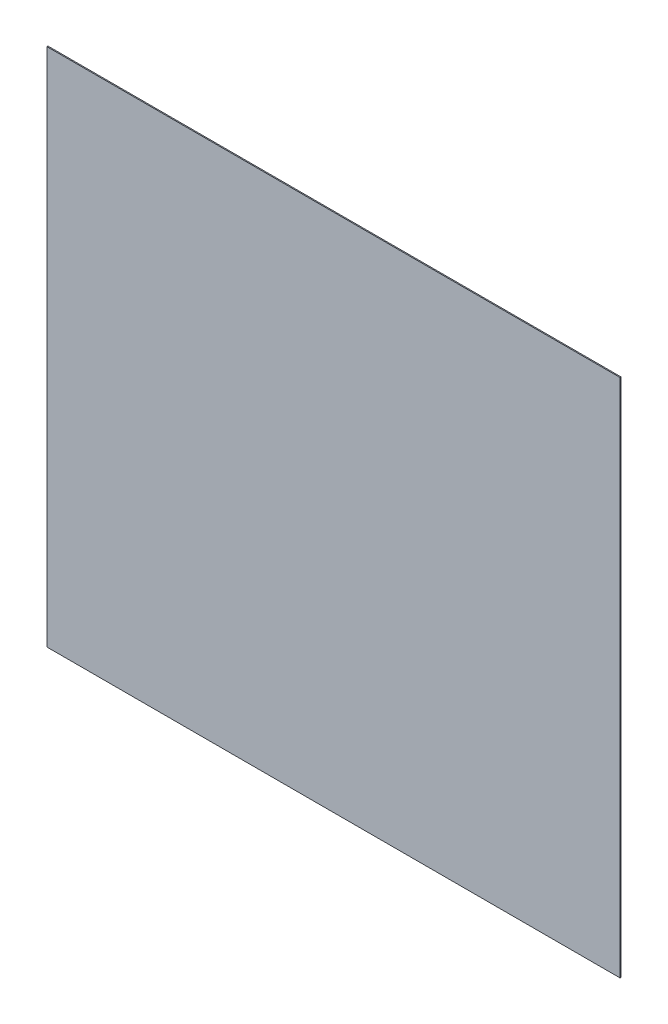
ISO-10303-21;
HEADER;
FILE_DESCRIPTION(('STEP AP214'),'2;1');
FILE_NAME('part.step','',(''),(''),'','','');
FILE_SCHEMA(('AUTOMOTIVE_DESIGN { 1 0 10303 214 1 1 1 1 }'));
ENDSEC;
DATA;
#1=APPLICATION_CONTEXT('core data for automotive mechanical design processes');
#2=APPLICATION_PROTOCOL_DEFINITION('international standard','automotive_design',2000,#1);
#3=PRODUCT_CONTEXT('',#1,'mechanical');
#4=PRODUCT('Part','Part','',(#3));
#5=PRODUCT_RELATED_PRODUCT_CATEGORY('part','',(#4));
#6=PRODUCT_DEFINITION_FORMATION('','',#4);
#7=PRODUCT_DEFINITION_CONTEXT('part definition',#1,'design');
#8=PRODUCT_DEFINITION('design','',#6,#7);
#9=PRODUCT_DEFINITION_SHAPE('','',#8);
#10=(LENGTH_UNIT() NAMED_UNIT(*) SI_UNIT(.MILLI.,.METRE.));
#11=(NAMED_UNIT(*) PLANE_ANGLE_UNIT() SI_UNIT($,.RADIAN.));
#12=(NAMED_UNIT(*) SI_UNIT($,.STERADIAN.) SOLID_ANGLE_UNIT());
#13=UNCERTAINTY_MEASURE_WITH_UNIT(LENGTH_MEASURE(1.E-05),#10,'distance_accuracy_value','');
#14=(GEOMETRIC_REPRESENTATION_CONTEXT(3) GLOBAL_UNCERTAINTY_ASSIGNED_CONTEXT((#13)) GLOBAL_UNIT_ASSIGNED_CONTEXT((#10,
#11,#12)) REPRESENTATION_CONTEXT('',''));
#15=CARTESIAN_POINT('',(0.,0.,0.));
#16=DIRECTION('',(0.,0.,1.));
#17=DIRECTION('',(1.,0.,0.));
#18=AXIS2_PLACEMENT_3D('',#15,#16,#17);
#19=CARTESIAN_POINT('',(2.158834554924E-05,-9.664392011418E-06,0.00100076));
#20=DIRECTION('',(0.,0.,1.));
#21=DIRECTION('',(1.,0.,0.));
#22=AXIS2_PLACEMENT_3D('',#19,#20,#21);
#23=PLANE('',#22);
#24=DIRECTION('',(-1.,0.,0.));
#25=VECTOR('',#24,1.);
#26=CARTESIAN_POINT('',(0.27518868,0.24957024,0.00100076));
#27=LINE('',#26,#25);
#28=CARTESIAN_POINT('',(0.27518868,0.24957024,0.00100076));
#29=VERTEX_POINT('',#28);
#30=CARTESIAN_POINT('',(-0.27510486,0.24957024,0.00100076));
#31=VERTEX_POINT('',#30);
#32=EDGE_CURVE('E84',#29,#31,#27,.T.);
#33=ORIENTED_EDGE('',*,*,#32,.T.);
#34=DIRECTION('',(-0.000162839926169632,-0.999999986741579,0.));
#35=VECTOR('',#34,1.);
#36=CARTESIAN_POINT('',(-0.27510486,0.24957024,0.00100076));
#37=LINE('',#36,#35);
#38=CARTESIAN_POINT('',(-0.27518614,-0.24957024,0.00100076));
#39=VERTEX_POINT('',#38);
#40=EDGE_CURVE('E99',#31,#39,#37,.T.);
#41=ORIENTED_EDGE('',*,*,#40,.T.);
#42=DIRECTION('',(1.,0.,0.));
#43=VECTOR('',#42,1.);
#44=CARTESIAN_POINT('',(-0.27518614,-0.24957024,0.00100076));
#45=LINE('',#44,#43);
#46=CARTESIAN_POINT('',(0.27518868,-0.24957024,0.00100076));
#47=VERTEX_POINT('',#46);
#48=EDGE_CURVE('E21',#39,#47,#45,.T.);
#49=ORIENTED_EDGE('',*,*,#48,.T.);
#50=DIRECTION('',(0.,1.,0.));
#51=VECTOR('',#50,1.);
#52=CARTESIAN_POINT('',(0.27518868,-0.24957024,0.00100076));
#53=LINE('',#52,#51);
#54=EDGE_CURVE('E11',#47,#29,#53,.T.);
#55=ORIENTED_EDGE('',*,*,#54,.T.);
#56=EDGE_LOOP('',(#33,#41,#49,#55));
#57=FACE_BOUND('',#56,.T.);
#58=ADVANCED_FACE('F17',(#57),#23,.T.);
#59=CARTESIAN_POINT('',(2.158834554924E-05,-9.664392011418E-06,0.));
#60=DIRECTION('',(0.,0.,1.));
#61=DIRECTION('',(1.,0.,0.));
#62=AXIS2_PLACEMENT_3D('',#59,#60,#61);
#63=PLANE('',#62);
#64=DIRECTION('',(0.,1.,0.));
#65=VECTOR('',#64,1.);
#66=CARTESIAN_POINT('',(0.27518868,-0.24957024,0.));
#67=LINE('',#66,#65);
#68=CARTESIAN_POINT('',(0.27518868,-0.24957024,0.));
#69=VERTEX_POINT('',#68);
#70=CARTESIAN_POINT('',(0.27518868,0.24957024,0.));
#71=VERTEX_POINT('',#70);
#72=EDGE_CURVE('E27',#69,#71,#67,.T.);
#73=ORIENTED_EDGE('',*,*,#72,.F.);
#74=DIRECTION('',(1.,0.,0.));
#75=VECTOR('',#74,1.);
#76=CARTESIAN_POINT('',(-0.27518614,-0.24957024,0.));
#77=LINE('',#76,#75);
#78=CARTESIAN_POINT('',(-0.27518614,-0.24957024,0.));
#79=VERTEX_POINT('',#78);
#80=EDGE_CURVE('E103',#79,#69,#77,.T.);
#81=ORIENTED_EDGE('',*,*,#80,.F.);
#82=DIRECTION('',(-0.000162839926169632,-0.999999986741579,0.));
#83=VECTOR('',#82,1.);
#84=CARTESIAN_POINT('',(-0.27510486,0.24957024,0.));
#85=LINE('',#84,#83);
#86=CARTESIAN_POINT('',(-0.27510486,0.24957024,0.));
#87=VERTEX_POINT('',#86);
#88=EDGE_CURVE('E86',#87,#79,#85,.T.);
#89=ORIENTED_EDGE('',*,*,#88,.F.);
#90=DIRECTION('',(-1.,0.,0.));
#91=VECTOR('',#90,1.);
#92=CARTESIAN_POINT('',(0.27518868,0.24957024,0.));
#93=LINE('',#92,#91);
#94=EDGE_CURVE('E82',#71,#87,#93,.T.);
#95=ORIENTED_EDGE('',*,*,#94,.F.);
#96=EDGE_LOOP('',(#73,#81,#89,#95));
#97=FACE_BOUND('',#96,.T.);
#98=ADVANCED_FACE('F19',(#97),#63,.F.);
#99=CARTESIAN_POINT('',(0.27518868,-0.24957024,0.));
#100=DIRECTION('',(-1.,0.,0.));
#101=DIRECTION('',(0.,0.,1.));
#102=AXIS2_PLACEMENT_3D('',#99,#100,#101);
#103=PLANE('',#102);
#104=ORIENTED_EDGE('',*,*,#72,.T.);
#105=DIRECTION('',(0.,0.,1.));
#106=VECTOR('',#105,1.);
#107=CARTESIAN_POINT('',(0.27518868,0.24957024,0.));
#108=LINE('',#107,#106);
#109=EDGE_CURVE('E71',#71,#29,#108,.T.);
#110=ORIENTED_EDGE('',*,*,#109,.T.);
#111=ORIENTED_EDGE('',*,*,#54,.F.);
#112=DIRECTION('',(0.,0.,1.));
#113=VECTOR('',#112,1.);
#114=CARTESIAN_POINT('',(0.27518868,-0.24957024,0.));
#115=LINE('',#114,#113);
#116=EDGE_CURVE('E74',#69,#47,#115,.T.);
#117=ORIENTED_EDGE('',*,*,#116,.F.);
#118=EDGE_LOOP('',(#104,#110,#111,#117));
#119=FACE_BOUND('',#118,.T.);
#120=ADVANCED_FACE('F70',(#119),#103,.F.);
#121=CARTESIAN_POINT('',(-0.27518614,-0.24957024,0.));
#122=DIRECTION('',(0.,1.,0.));
#123=DIRECTION('',(1.,0.,0.));
#124=AXIS2_PLACEMENT_3D('',#121,#122,#123);
#125=PLANE('',#124);
#126=ORIENTED_EDGE('',*,*,#80,.T.);
#127=ORIENTED_EDGE('',*,*,#116,.T.);
#128=ORIENTED_EDGE('',*,*,#48,.F.);
#129=DIRECTION('',(0.,0.,1.));
#130=VECTOR('',#129,1.);
#131=CARTESIAN_POINT('',(-0.27518614,-0.24957024,0.));
#132=LINE('',#131,#130);
#133=EDGE_CURVE('E104',#79,#39,#132,.T.);
#134=ORIENTED_EDGE('',*,*,#133,.F.);
#135=EDGE_LOOP('',(#126,#127,#128,#134));
#136=FACE_BOUND('',#135,.T.);
#137=ADVANCED_FACE('F119',(#136),#125,.F.);
#138=CARTESIAN_POINT('',(-0.27510486,0.24957024,0.));
#139=DIRECTION('',(0.999999986741579,-0.000162839926169632,0.));
#140=DIRECTION('',(0.,0.,-1.));
#141=AXIS2_PLACEMENT_3D('',#138,#139,#140);
#142=PLANE('',#141);
#143=ORIENTED_EDGE('',*,*,#88,.T.);
#144=ORIENTED_EDGE('',*,*,#133,.T.);
#145=ORIENTED_EDGE('',*,*,#40,.F.);
#146=DIRECTION('',(0.,0.,1.));
#147=VECTOR('',#146,1.);
#148=CARTESIAN_POINT('',(-0.27510486,0.24957024,0.));
#149=LINE('',#148,#147);
#150=EDGE_CURVE('E91',#87,#31,#149,.T.);
#151=ORIENTED_EDGE('',*,*,#150,.F.);
#152=EDGE_LOOP('',(#143,#144,#145,#151));
#153=FACE_BOUND('',#152,.T.);
#154=ADVANCED_FACE('F121',(#153),#142,.F.);
#155=CARTESIAN_POINT('',(0.27518868,0.24957024,0.));
#156=DIRECTION('',(0.,-1.,0.));
#157=DIRECTION('',(0.,0.,-1.));
#158=AXIS2_PLACEMENT_3D('',#155,#156,#157);
#159=PLANE('',#158);
#160=ORIENTED_EDGE('',*,*,#94,.T.);
#161=ORIENTED_EDGE('',*,*,#150,.T.);
#162=ORIENTED_EDGE('',*,*,#32,.F.);
#163=ORIENTED_EDGE('',*,*,#109,.F.);
#164=EDGE_LOOP('',(#160,#161,#162,#163));
#165=FACE_BOUND('',#164,.T.);
#166=ADVANCED_FACE('F80',(#165),#159,.F.);
#167=CLOSED_SHELL('',(#58,#98,#120,#137,#154,#166));
#168=MANIFOLD_SOLID_BREP('B1',#167);
#169=ADVANCED_BREP_SHAPE_REPRESENTATION('',(#18,#168),#14);
#170=SHAPE_DEFINITION_REPRESENTATION(#9,#169);
ENDSEC;
END-ISO-10303-21;
